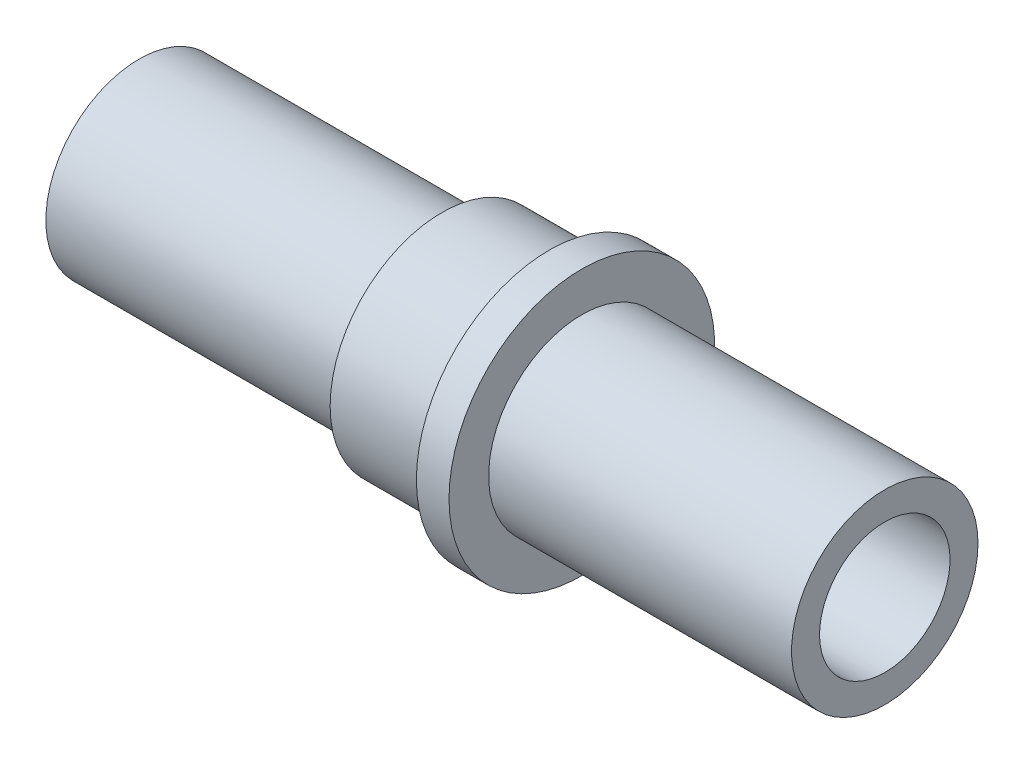
ISO-10303-21;
HEADER;
FILE_DESCRIPTION(('STEP AP214'),'2;1');
FILE_NAME('part.step','',(''),(''),'','','');
FILE_SCHEMA(('AUTOMOTIVE_DESIGN { 1 0 10303 214 1 1 1 1 }'));
ENDSEC;
DATA;
#1=APPLICATION_CONTEXT('core data for automotive mechanical design processes');
#2=APPLICATION_PROTOCOL_DEFINITION('international standard','automotive_design',2000,#1);
#3=PRODUCT_CONTEXT('',#1,'mechanical');
#4=PRODUCT('Part','Part','',(#3));
#5=PRODUCT_RELATED_PRODUCT_CATEGORY('part','',(#4));
#6=PRODUCT_DEFINITION_FORMATION('','',#4);
#7=PRODUCT_DEFINITION_CONTEXT('part definition',#1,'design');
#8=PRODUCT_DEFINITION('design','',#6,#7);
#9=PRODUCT_DEFINITION_SHAPE('','',#8);
#10=(LENGTH_UNIT() NAMED_UNIT(*) SI_UNIT(.MILLI.,.METRE.));
#11=(NAMED_UNIT(*) PLANE_ANGLE_UNIT() SI_UNIT($,.RADIAN.));
#12=(NAMED_UNIT(*) SI_UNIT($,.STERADIAN.) SOLID_ANGLE_UNIT());
#13=UNCERTAINTY_MEASURE_WITH_UNIT(LENGTH_MEASURE(1.E-05),#10,'distance_accuracy_value','');
#14=(GEOMETRIC_REPRESENTATION_CONTEXT(3) GLOBAL_UNCERTAINTY_ASSIGNED_CONTEXT((#13)) GLOBAL_UNIT_ASSIGNED_CONTEXT((#10,
#11,#12)) REPRESENTATION_CONTEXT('',''));
#15=CARTESIAN_POINT('',(0.,0.,0.));
#16=DIRECTION('',(0.,0.,1.));
#17=DIRECTION('',(1.,0.,0.));
#18=AXIS2_PLACEMENT_3D('',#15,#16,#17);
#19=CARTESIAN_POINT('',(80.,0.,-14.));
#20=DIRECTION('',(-1.,0.,0.));
#21=DIRECTION('',(0.,0.,1.));
#22=AXIS2_PLACEMENT_3D('',#19,#20,#21);
#23=PLANE('',#22);
#24=CARTESIAN_POINT('',(80.,0.,0.));
#25=DIRECTION('',(-1.,0.,0.));
#26=DIRECTION('',(0.,0.,1.));
#27=AXIS2_PLACEMENT_3D('',#24,#25,#26);
#28=CIRCLE('',#27,14.);
#29=CARTESIAN_POINT('',(80.,0.,14.));
#30=VERTEX_POINT('',#29);
#31=EDGE_CURVE('E337',#30,#30,#28,.T.);
#32=ORIENTED_EDGE('',*,*,#31,.T.);
#33=EDGE_LOOP('',(#32));
#34=FACE_BOUND('',#33,.T.);
#35=CARTESIAN_POINT('',(80.,0.,0.));
#36=DIRECTION('',(1.,0.,0.));
#37=DIRECTION('',(0.,0.,-1.));
#38=AXIS2_PLACEMENT_3D('',#35,#36,#37);
#39=CIRCLE('',#38,20.);
#40=CARTESIAN_POINT('',(80.,0.,-20.));
#41=VERTEX_POINT('',#40);
#42=EDGE_CURVE('E195',#41,#41,#39,.T.);
#43=ORIENTED_EDGE('',*,*,#42,.T.);
#44=EDGE_LOOP('',(#43));
#45=FACE_BOUND('',#44,.T.);
#46=ADVANCED_FACE('F36',(#34,#45),#23,.F.);
#47=CARTESIAN_POINT('',(51.5,0.,-85.));
#48=DIRECTION('',(0.,0.,1.));
#49=DIRECTION('',(1.,0.,0.));
#50=AXIS2_PLACEMENT_3D('',#47,#48,#49);
#51=CYLINDRICAL_SURFACE('',#50,2.75);
#52=CARTESIAN_POINT('',(54.25,0.,-15.5));
#53=CARTESIAN_POINT('',(54.2499939963702,-0.153180130361028,-15.4999972885771));
#54=CARTESIAN_POINT('',(54.2371581270707,-0.306440134931247,-15.4977057266277));
#55=CARTESIAN_POINT('',(54.1861810109078,-0.608651473095552,-15.4887849983757));
#56=CARTESIAN_POINT('',(54.1480174539571,-0.75759888708506,-15.4821520079637));
#57=CARTESIAN_POINT('',(54.0475819905019,-1.04676982237026,-15.4652914012013));
#58=CARTESIAN_POINT('',(53.9853308398008,-1.18700073408951,-15.4550668802993));
#59=CARTESIAN_POINT('',(53.8385439603777,-1.45501211811525,-15.4321435486864));
#60=CARTESIAN_POINT('',(53.754010404133,-1.58279380252694,-15.4194449792204));
#61=CARTESIAN_POINT('',(53.5640903864043,-1.82367177085956,-15.392825207877));
#62=CARTESIAN_POINT('',(53.4585105975018,-1.93661446910276,-15.3788933917032));
#63=CARTESIAN_POINT('',(53.2299111628025,-2.14328074013775,-15.3514573238523));
#64=CARTESIAN_POINT('',(53.1068903429675,-2.23700301807208,-15.3379531010336));
#65=CARTESIAN_POINT('',(52.845830548068,-2.40319530372064,-15.3127982803892));
#66=CARTESIAN_POINT('',(52.7076920504413,-2.47551123413061,-15.3011613847414));
#67=CARTESIAN_POINT('',(52.4209865611345,-2.59585222842665,-15.2812072720814));
#68=CARTESIAN_POINT('',(52.2724203719374,-2.64387915919015,-15.2728897999454));
#69=CARTESIAN_POINT('',(51.9707126947854,-2.71379037165771,-15.2606225605476));
#70=CARTESIAN_POINT('',(51.8176348132209,-2.73594119260959,-15.2566282937488));
#71=CARTESIAN_POINT('',(51.5098870542164,-2.75429827638896,-15.2533253385218));
#72=CARTESIAN_POINT('',(51.3552173054712,-2.75050662034128,-15.2540162742431));
#73=CARTESIAN_POINT('',(51.0505931626678,-2.71730299428448,-15.2599650838784));
#74=CARTESIAN_POINT('',(50.9006047305081,-2.68819227238425,-15.2651692568643));
#75=CARTESIAN_POINT('',(50.6076750627876,-2.60565045526888,-15.2794739594867));
#76=CARTESIAN_POINT('',(50.4647340983231,-2.5522184252887,-15.2885746388806));
#77=CARTESIAN_POINT('',(50.1890653515444,-2.42225075977002,-15.3097040089906));
#78=CARTESIAN_POINT('',(50.0563969689134,-2.34559176891981,-15.3217482649268));
#79=CARTESIAN_POINT('',(49.8056926891078,-2.17143365568382,-15.3473971637188));
#80=CARTESIAN_POINT('',(49.6876581276022,-2.07393263319782,-15.3610019487905));
#81=CARTESIAN_POINT('',(49.4678298898382,-1.85922540545412,-15.3884739714275));
#82=CARTESIAN_POINT('',(49.3662882295651,-1.74176112865291,-15.4023422075672));
#83=CARTESIAN_POINT('',(49.1843160503384,-1.49132991955348,-15.4286020251595));
#84=CARTESIAN_POINT('',(49.1038857031806,-1.35836286111228,-15.4409935945951));
#85=CARTESIAN_POINT('',(48.9663892511231,-1.08045057847522,-15.462925072433));
#86=CARTESIAN_POINT('',(48.9093473886423,-0.935493112112764,-15.4724620192382));
#87=CARTESIAN_POINT('',(48.8204914576501,-0.637847733020219,-15.4875864076149));
#88=CARTESIAN_POINT('',(48.7886749936342,-0.485160555799655,-15.4931742242061));
#89=CARTESIAN_POINT('',(48.7515192342325,-0.178560124995444,-15.499719785447));
#90=CARTESIAN_POINT('',(48.7458343110531,-0.0246900035401979,-15.5007379659188));
#91=CARTESIAN_POINT('',(48.7601787124678,0.281803018450218,-15.4981957721587));
#92=CARTESIAN_POINT('',(48.7802069107975,0.434425973318056,-15.494635598464));
#93=CARTESIAN_POINT('',(48.8451215906047,0.73301025947731,-15.4833742389245));
#94=CARTESIAN_POINT('',(48.8898350613166,0.879010386498074,-15.4757018847638));
#95=CARTESIAN_POINT('',(49.0026652014778,1.16144212089452,-15.4570728626086));
#96=CARTESIAN_POINT('',(49.0707833266586,1.29787313245106,-15.4461159903278));
#97=CARTESIAN_POINT('',(49.2292673561634,1.55878202434307,-15.4219828077083));
#98=CARTESIAN_POINT('',(49.3198468005166,1.68312822282852,-15.4087856023348));
#99=CARTESIAN_POINT('',(49.5203909273236,1.91497931304751,-15.3816938056365));
#100=CARTESIAN_POINT('',(49.6303572183307,2.02248280591962,-15.3677991565122));
#101=CARTESIAN_POINT('',(49.8681111328447,2.21889424843837,-15.3406804971823));
#102=CARTESIAN_POINT('',(49.9960939752784,2.30756747023747,-15.32746635088));
#103=CARTESIAN_POINT('',(50.2653418206475,2.46215643166306,-15.3033960908013));
#104=CARTESIAN_POINT('',(50.4066063637658,2.52807295876566,-15.2925398954347));
#105=CARTESIAN_POINT('',(50.697781683498,2.63493545141031,-15.2744904482524));
#106=CARTESIAN_POINT('',(50.8476502233147,2.6759935994284,-15.2672807648766));
#107=CARTESIAN_POINT('',(51.1522968470489,2.73232352690328,-15.2573012293778));
#108=CARTESIAN_POINT('',(51.3070744394966,2.74759787945412,-15.2545309342275));
#109=CARTESIAN_POINT('',(51.6147981715155,2.75184762497001,-15.2537646465042));
#110=CARTESIAN_POINT('',(51.7677391603609,2.74119285810098,-15.255701512772));
#111=CARTESIAN_POINT('',(52.0696142615317,2.69469154527426,-15.2639832956324));
#112=CARTESIAN_POINT('',(52.2185483920815,2.65884511391588,-15.2703281921723));
#113=CARTESIAN_POINT('',(52.5080109314647,2.5631270178078,-15.2866842128252));
#114=CARTESIAN_POINT('',(52.6485515674712,2.50329133116671,-15.2966898447602));
#115=CARTESIAN_POINT('',(52.917658894897,2.36133238124133,-15.3192445058943));
#116=CARTESIAN_POINT('',(53.046224863738,2.27920777416209,-15.331793688432));
#117=CARTESIAN_POINT('',(53.2895940005749,2.09369934417613,-15.3582321219391));
#118=CARTESIAN_POINT('',(53.4041891860807,1.99004486745666,-15.3721371042235));
#119=CARTESIAN_POINT('',(53.6144842305246,1.76498695279942,-15.3995988886769));
#120=CARTESIAN_POINT('',(53.7101797361345,1.64357943683116,-15.4131556100038));
#121=CARTESIAN_POINT('',(53.8806615462765,1.3853111016427,-15.4385189460145));
#122=CARTESIAN_POINT('',(53.9552758481905,1.24833526696905,-15.4503108145182));
#123=CARTESIAN_POINT('',(54.0803168976558,0.963633486922668,-15.470672261639));
#124=CARTESIAN_POINT('',(54.1307670507415,0.81591810436598,-15.4792449566202));
#125=CARTESIAN_POINT('',(54.1954501173467,0.556413889631343,-15.490392756442));
#126=CARTESIAN_POINT('',(54.2158724720239,0.446169564440767,-15.4939756739413));
#127=CARTESIAN_POINT('',(54.2431494651094,0.22396436987743,-15.4987802620907));
#128=CARTESIAN_POINT('',(54.2500043897846,0.112003536772482,-15.500001982561));
#129=CARTESIAN_POINT('',(54.25,0.,-15.5));
#130=B_SPLINE_CURVE_WITH_KNOTS('',3,(#52,#53,#54,#55,#56,#57,#58,#59,#60,#61,#62,#63,#64,#65,
#66,#67,#68,#69,#70,#71,#72,#73,#74,#75,#76,#77,#78,#79,#80,#81,#82,#83,#84,#85,#86,#87,#88,#89,
#90,#91,#92,#93,#94,#95,#96,#97,#98,#99,#100,#101,#102,#103,#104,#105,#106,#107,#108,#109,#110,
#111,#112,#113,#114,#115,#116,#117,#118,#119,#120,#121,#122,#123,#124,#125,#126,#127,#128,#129),
.UNSPECIFIED.,.T.,.F.,(4,2,2,2,2,2,2,2,2,2,2,2,2,2,2,2,2,2,2,2,2,2,2,2,2,2,2,2,2,2,2,2,2,2,2,2,
2,2,4),(0.,0.459130887515952,0.918666741724481,1.37780750160954,1.83690351299508,
2.30042905710988,2.76398581815316,3.23080224595071,3.69758278830366,4.15951159227084,
4.62140334039995,5.07787350295806,5.53436121097001,5.99331707175174,6.45231479190446,
6.91777389539432,7.3832367864947,7.84918092270293,8.31508080569667,8.77480040707501,
9.23449987289005,9.69101762643085,10.1475637797748,10.6086289377284,11.069732368912,
11.5362840564694,12.0028195977831,12.4672337221527,12.9316014975709,13.3893846785101,
13.8471657769628,14.3042628669993,14.7613875214604,15.2246502789878,15.6880196197348,
16.155067091883,16.6216612596877,16.9573795293277,17.2930907153809),.UNSPECIFIED.);
#131=CARTESIAN_POINT('',(48.75,0.,-15.5));
#132=VERTEX_POINT('',#131);
#133=CARTESIAN_POINT('',(54.25,0.,-15.5));
#134=VERTEX_POINT('',#133);
#135=EDGE_CURVE('E76',#132,#134,#130,.T.);
#136=ORIENTED_EDGE('',*,*,#135,.F.);
#137=EDGE_CURVE('E59',#134,#132,#130,.T.);
#138=ORIENTED_EDGE('',*,*,#137,.F.);
#139=EDGE_LOOP('',(#136,#138));
#140=FACE_BOUND('',#139,.T.);
#141=CARTESIAN_POINT('',(54.25,0.,-20.));
#142=CARTESIAN_POINT('',(54.249993556765,0.153691048302081,-19.9999976879118));
#143=CARTESIAN_POINT('',(54.2370723824231,0.307474866785848,-19.9982097880638));
#144=CARTESIAN_POINT('',(54.1857364594133,0.610754046163105,-19.9912495204842));
#145=CARTESIAN_POINT('',(54.147295948863,0.760244914044189,-19.9860737327388));
#146=CARTESIAN_POINT('',(54.0460831856731,1.05050443026029,-19.9729200836122));
#147=CARTESIAN_POINT('',(53.9833282770853,1.19127921315922,-19.9649442199732));
#148=CARTESIAN_POINT('',(53.8353082313726,1.46027546254501,-19.9470747441709));
#149=CARTESIAN_POINT('',(53.7500466026017,1.58849888127546,-19.937181430964));
#150=CARTESIAN_POINT('',(53.558831928412,1.82962437694935,-19.9165064057125));
#151=CARTESIAN_POINT('',(53.4527596510701,1.94243149144407,-19.9057197917769));
#152=CARTESIAN_POINT('',(53.2231910446311,2.14870361790335,-19.8845128481702));
#153=CARTESIAN_POINT('',(53.0996937753982,2.24216758556995,-19.8740925383002));
#154=CARTESIAN_POINT('',(52.8381532746243,2.40746197972028,-19.8547501988817));
#155=CARTESIAN_POINT('',(52.7000523950882,2.47920199596257,-19.8458344974589));
#156=CARTESIAN_POINT('',(52.4136192057626,2.59843449792071,-19.8305767271721));
#157=CARTESIAN_POINT('',(52.2652873646832,2.64592809359916,-19.8242345404993));
#158=CARTESIAN_POINT('',(51.9635952156628,2.71502784404444,-19.8148894574374));
#159=CARTESIAN_POINT('',(51.8102725525694,2.73679549136394,-19.81186573829));
#160=CARTESIAN_POINT('',(51.5021230204438,2.754325433017,-19.8094364998907));
#161=CARTESIAN_POINT('',(51.3472962245755,2.75008898597912,-19.8100308055221));
#162=CARTESIAN_POINT('',(51.0416661439927,2.71586327569488,-19.8147514149341));
#163=CARTESIAN_POINT('',(50.8908424005475,2.68605283888437,-19.8188531920345));
#164=CARTESIAN_POINT('',(50.5963583824647,2.60180481135229,-19.8300883008704));
#165=CARTESIAN_POINT('',(50.4526982807183,2.54736662657047,-19.8372217057334));
#166=CARTESIAN_POINT('',(50.1760694616357,2.41521917583683,-19.853743790879));
#167=CARTESIAN_POINT('',(50.043137878724,2.33743314066148,-19.86313989058));
#168=CARTESIAN_POINT('',(49.7921467825863,2.16085284684145,-19.883123118533));
#169=CARTESIAN_POINT('',(49.674088091884,2.06205742711449,-19.8937103125955));
#170=CARTESIAN_POINT('',(49.4551567976275,1.84527625482177,-19.9149915483879));
#171=CARTESIAN_POINT('',(49.3544365899711,1.72713654653894,-19.9256857417053));
#172=CARTESIAN_POINT('',(49.1742311055461,1.47554786234239,-19.9458932662357));
#173=CARTESIAN_POINT('',(49.0947458969199,1.34209883730352,-19.9554065936593));
#174=CARTESIAN_POINT('',(48.9592629163206,1.06355516601991,-19.9721882349705));
#175=CARTESIAN_POINT('',(48.9032757441426,0.918455299247463,-19.9794555353027));
#176=CARTESIAN_POINT('',(48.8165045661456,0.620791279029389,-19.990917492439));
#177=CARTESIAN_POINT('',(48.7857191307701,0.468227549488177,-19.995112323526));
#178=CARTESIAN_POINT('',(48.7504252761674,0.161283058145392,-19.9999338446021));
#179=CARTESIAN_POINT('',(48.7457071267834,0.00692684232008186,-20.0005890127891));
#180=CARTESIAN_POINT('',(48.7621267616201,-0.3003742868181,-19.9983345801951));
#181=CARTESIAN_POINT('',(48.7832638764852,-0.453319236563339,-19.9954250716985));
#182=CARTESIAN_POINT('',(48.8506197084105,-0.752829586427977,-19.986385858488));
#183=CARTESIAN_POINT('',(48.8967373812643,-0.899418135103156,-19.9802691298716));
#184=CARTESIAN_POINT('',(49.0126394486303,-1.18278160079774,-19.9654996606529));
#185=CARTESIAN_POINT('',(49.0824247971592,-1.31955612195573,-19.9568468178248));
#186=CARTESIAN_POINT('',(49.2441813284002,-1.58033880542293,-19.9378973265661));
#187=CARTESIAN_POINT('',(49.3362869259039,-1.7042628671375,-19.9275908519361));
#188=CARTESIAN_POINT('',(49.5398807095436,-1.93496873160381,-19.9065150547392));
#189=CARTESIAN_POINT('',(49.6513698340405,-2.04174970397319,-19.8957457097836));
#190=CARTESIAN_POINT('',(49.8914945464765,-2.23589151734344,-19.8748688995989));
#191=CARTESIAN_POINT('',(50.0202436634895,-2.32311257053476,-19.8647665414263));
#192=CARTESIAN_POINT('',(50.2906878545255,-2.47469012437468,-19.8464546602125));
#193=CARTESIAN_POINT('',(50.4323826243274,-2.5390471621512,-19.838245092707));
#194=CARTESIAN_POINT('',(50.7242612690282,-2.64284809930283,-19.8246842167451));
#195=CARTESIAN_POINT('',(50.8744175863039,-2.68236829607907,-19.8193241626372));
#196=CARTESIAN_POINT('',(51.1793144373862,-2.73561813038544,-19.8120450180285));
#197=CARTESIAN_POINT('',(51.3340547085819,-2.74934924245849,-19.8101257307952));
#198=CARTESIAN_POINT('',(51.6423351128222,-2.75060023253872,-19.809951954788));
#199=CARTESIAN_POINT('',(51.7958743828355,-2.73833979250839,-19.8116667505137));
#200=CARTESIAN_POINT('',(52.0986866416265,-2.68842356823614,-19.8185015492629));
#201=CARTESIAN_POINT('',(52.2479596331651,-2.65076780042872,-19.8236215500829));
#202=CARTESIAN_POINT('',(52.5379577433389,-2.55120289622579,-19.8366797711636));
#203=CARTESIAN_POINT('',(52.6786873569408,-2.48930664358651,-19.8446164941339));
#204=CARTESIAN_POINT('',(52.9477992253764,-2.34303939462444,-19.8624160290793));
#205=CARTESIAN_POINT('',(53.0761811982783,-2.25866788529321,-19.872278885018));
#206=CARTESIAN_POINT('',(53.3180734263252,-2.06903786707165,-19.8929190033365));
#207=CARTESIAN_POINT('',(53.4314550912826,-1.96361604756685,-19.9037030122198));
#208=CARTESIAN_POINT('',(53.6389992301106,-1.73522182634597,-19.9249123085487));
#209=CARTESIAN_POINT('',(53.7331572001367,-1.61224532325241,-19.9353375114564));
#210=CARTESIAN_POINT('',(53.8999595769867,-1.35157476242149,-19.9547084991948));
#211=CARTESIAN_POINT('',(53.9725030981721,-1.21381564808709,-19.9636472629714));
#212=CARTESIAN_POINT('',(54.0933186529561,-0.928017694341463,-19.9789684515391));
#213=CARTESIAN_POINT('',(54.1416164726682,-0.779989967531116,-19.9853535907188));
#214=CARTESIAN_POINT('',(54.2012954052979,-0.526036164028963,-19.9933476747436));
#215=CARTESIAN_POINT('',(54.21953259448,-0.421696231828042,-19.9958298315073));
#216=CARTESIAN_POINT('',(54.2438870515407,-0.21158551548677,-19.9991567821786));
#217=CARTESIAN_POINT('',(54.2500044361027,-0.105814745131687,-20.0000015918496));
#218=CARTESIAN_POINT('',(54.25,0.,-20.));
#219=B_SPLINE_CURVE_WITH_KNOTS('',3,(#141,#142,#143,#144,#145,#146,#147,#148,#149,#150,#151,
#152,#153,#154,#155,#156,#157,#158,#159,#160,#161,#162,#163,#164,#165,#166,#167,#168,#169,#170,
#171,#172,#173,#174,#175,#176,#177,#178,#179,#180,#181,#182,#183,#184,#185,#186,#187,#188,#189,
#190,#191,#192,#193,#194,#195,#196,#197,#198,#199,#200,#201,#202,#203,#204,#205,#206,#207,#208,
#209,#210,#211,#212,#213,#214,#215,#216,#217,#218),.UNSPECIFIED.,.T.,.F.,(4,2,2,2,2,2,2,2,2,2,2,
2,2,2,2,2,2,2,2,2,2,2,2,2,2,2,2,2,2,2,2,2,2,2,2,2,2,2,4),(0.,0.460686566621732,
0.921838907005325,1.38266290003487,1.84341510206454,2.30688856308806,2.77038703959676,
3.23578878962265,3.70116923238555,4.16361250233735,4.62603338967068,5.08524690610813,
5.54447150009298,6.00522291014889,6.46599979022204,6.93064004546858,7.39528179171355,
7.86013290981609,8.32495765763194,8.7860370477441,9.24710450142771,9.70632075397659,
10.1655555192026,10.6276277437701,11.0897223435888,11.5550209869023,12.0203086985659,
12.4841599942269,12.9479847674472,13.4079049062956,13.8678247475085,14.3275004735171,
14.787186692742,15.2505884002799,15.7140985521237,16.1797394187917,16.6448840060744,
16.962065139875,17.2792432199988),.UNSPECIFIED.);
#220=CARTESIAN_POINT('',(54.25,0.,-20.));
#221=VERTEX_POINT('',#220);
#222=EDGE_CURVE('E187',#221,#221,#219,.T.);
#223=ORIENTED_EDGE('',*,*,#222,.F.);
#224=EDGE_LOOP('',(#223));
#225=FACE_BOUND('',#224,.T.);
#226=ADVANCED_FACE('F99',(#140,#225),#51,.F.);
#227=CARTESIAN_POINT('',(-80.,0.,-24.));
#228=DIRECTION('',(1.,0.,0.));
#229=DIRECTION('',(0.,0.,-1.));
#230=AXIS2_PLACEMENT_3D('',#227,#228,#229);
#231=PLANE('',#230);
#232=CARTESIAN_POINT('',(-80.,0.,0.));
#233=DIRECTION('',(-1.,0.,0.));
#234=DIRECTION('',(0.,0.,1.));
#235=AXIS2_PLACEMENT_3D('',#232,#233,#234);
#236=CIRCLE('',#235,14.);
#237=CARTESIAN_POINT('',(-80.,0.,14.));
#238=VERTEX_POINT('',#237);
#239=EDGE_CURVE('E11',#238,#238,#236,.T.);
#240=ORIENTED_EDGE('',*,*,#239,.F.);
#241=EDGE_LOOP('',(#240));
#242=FACE_BOUND('',#241,.T.);
#243=CARTESIAN_POINT('',(-80.,0.,0.));
#244=DIRECTION('',(1.,0.,0.));
#245=DIRECTION('',(0.,0.,-1.));
#246=AXIS2_PLACEMENT_3D('',#243,#244,#245);
#247=CIRCLE('',#246,20.);
#248=CARTESIAN_POINT('',(-80.,0.,-20.));
#249=VERTEX_POINT('',#248);
#250=EDGE_CURVE('E83',#249,#249,#247,.T.);
#251=ORIENTED_EDGE('',*,*,#250,.F.);
#252=EDGE_LOOP('',(#251));
#253=FACE_BOUND('',#252,.T.);
#254=ADVANCED_FACE('F38',(#242,#253),#231,.F.);
#255=CARTESIAN_POINT('',(-80.,0.,0.));
#256=DIRECTION('',(-1.,0.,0.));
#257=DIRECTION('',(0.,0.,1.));
#258=AXIS2_PLACEMENT_3D('',#255,#256,#257);
#259=CYLINDRICAL_SURFACE('',#258,14.);
#260=CARTESIAN_POINT('',(-54.25,0.,0.));
#261=DIRECTION('',(-1.,0.,0.));
#262=DIRECTION('',(0.,0.,1.));
#263=AXIS2_PLACEMENT_3D('',#260,#261,#262);
#264=CIRCLE('',#263,14.);
#265=CARTESIAN_POINT('',(-54.25,0.,14.));
#266=VERTEX_POINT('',#265);
#267=EDGE_CURVE('E45',#266,#266,#264,.T.);
#268=ORIENTED_EDGE('',*,*,#267,.F.);
#269=EDGE_LOOP('',(#268));
#270=FACE_BOUND('',#269,.T.);
#271=ORIENTED_EDGE('',*,*,#239,.T.);
#272=EDGE_LOOP('',(#271));
#273=FACE_BOUND('',#272,.T.);
#274=ADVANCED_FACE('F177',(#270,#273),#259,.F.);
#275=CARTESIAN_POINT('',(-54.25,0.,-14.));
#276=DIRECTION('',(-1.,0.,0.));
#277=DIRECTION('',(0.,0.,1.));
#278=AXIS2_PLACEMENT_3D('',#275,#276,#277);
#279=PLANE('',#278);
#280=ORIENTED_EDGE('',*,*,#267,.T.);
#281=EDGE_LOOP('',(#280));
#282=FACE_BOUND('',#281,.T.);
#283=CARTESIAN_POINT('',(-54.25,0.,0.));
#284=DIRECTION('',(-1.,0.,0.));
#285=DIRECTION('',(0.,0.,1.));
#286=AXIS2_PLACEMENT_3D('',#283,#284,#285);
#287=CIRCLE('',#286,15.5);
#288=CARTESIAN_POINT('',(-54.25,0.,-15.5));
#289=VERTEX_POINT('',#288);
#290=EDGE_CURVE('E74',#289,#289,#287,.T.);
#291=ORIENTED_EDGE('',*,*,#290,.F.);
#292=EDGE_LOOP('',(#291));
#293=FACE_BOUND('',#292,.T.);
#294=ADVANCED_FACE('F162',(#282,#293),#279,.F.);
#295=CARTESIAN_POINT('',(-80.,0.,0.));
#296=DIRECTION('',(-1.,0.,0.));
#297=DIRECTION('',(0.,0.,1.));
#298=AXIS2_PLACEMENT_3D('',#295,#296,#297);
#299=CYLINDRICAL_SURFACE('',#298,15.5);
#300=CARTESIAN_POINT('',(-48.75,0.,0.));
#301=DIRECTION('',(-1.,0.,0.));
#302=DIRECTION('',(0.,0.,1.));
#303=AXIS2_PLACEMENT_3D('',#300,#301,#302);
#304=CIRCLE('',#303,15.5);
#305=CARTESIAN_POINT('',(-48.75,0.,-15.5));
#306=VERTEX_POINT('',#305);
#307=EDGE_CURVE('E75',#306,#306,#304,.T.);
#308=ORIENTED_EDGE('',*,*,#307,.F.);
#309=CARTESIAN_POINT('',(-48.75,0.,-15.5));
#310=CARTESIAN_POINT('',(-48.7500060036299,-0.153180130361028,-15.4999972885771));
#311=CARTESIAN_POINT('',(-48.7628418729293,-0.306440134931246,-15.4977057266277));
#312=CARTESIAN_POINT('',(-48.8138189890922,-0.608651473095552,-15.4887849983757));
#313=CARTESIAN_POINT('',(-48.851982546043,-0.75759888708506,-15.4821520079637));
#314=CARTESIAN_POINT('',(-48.9524180094982,-1.04676982237026,-15.4652914012013));
#315=CARTESIAN_POINT('',(-49.0146691601992,-1.18700073408951,-15.4550668802993));
#316=CARTESIAN_POINT('',(-49.1614560396224,-1.45501211811525,-15.4321435486864));
#317=CARTESIAN_POINT('',(-49.2459895958671,-1.58279380252694,-15.4194449792204));
#318=CARTESIAN_POINT('',(-49.4359096135957,-1.82367177085956,-15.392825207877));
#319=CARTESIAN_POINT('',(-49.5414894024983,-1.93661446910276,-15.3788933917032));
#320=CARTESIAN_POINT('',(-49.7700888371975,-2.14328074013775,-15.3514573238523));
#321=CARTESIAN_POINT('',(-49.8931096570326,-2.23700301807208,-15.3379531010336));
#322=CARTESIAN_POINT('',(-50.154169451932,-2.40319530372064,-15.3127982803892));
#323=CARTESIAN_POINT('',(-50.2923079495588,-2.47551123413061,-15.3011613847414));
#324=CARTESIAN_POINT('',(-50.5790134388655,-2.59585222842665,-15.2812072720814));
#325=CARTESIAN_POINT('',(-50.7275796280626,-2.64387915919015,-15.2728897999454));
#326=CARTESIAN_POINT('',(-51.0292873052146,-2.71379037165771,-15.2606225605476));
#327=CARTESIAN_POINT('',(-51.1823651867791,-2.73594119260959,-15.2566282937488));
#328=CARTESIAN_POINT('',(-51.4901129457836,-2.75429827638896,-15.2533253385218));
#329=CARTESIAN_POINT('',(-51.6447826945289,-2.75050662034128,-15.2540162742431));
#330=CARTESIAN_POINT('',(-51.9494068373323,-2.71730299428448,-15.2599650838784));
#331=CARTESIAN_POINT('',(-52.0993952694919,-2.68819227238425,-15.2651692568643));
#332=CARTESIAN_POINT('',(-52.3923249372125,-2.60565045526888,-15.2794739594867));
#333=CARTESIAN_POINT('',(-52.535265901677,-2.5522184252887,-15.2885746388806));
#334=CARTESIAN_POINT('',(-52.8109346484556,-2.42225075977001,-15.3097040089906));
#335=CARTESIAN_POINT('',(-52.9436030310866,-2.34559176891981,-15.3217482649268));
#336=CARTESIAN_POINT('',(-53.1943073108923,-2.17143365568382,-15.3473971637188));
#337=CARTESIAN_POINT('',(-53.3123418723978,-2.07393263319782,-15.3610019487905));
#338=CARTESIAN_POINT('',(-53.5321701101618,-1.85922540545412,-15.3884739714275));
#339=CARTESIAN_POINT('',(-53.6337117704349,-1.74176112865291,-15.4023422075672));
#340=CARTESIAN_POINT('',(-53.8156839496617,-1.49132991955348,-15.4286020251595));
#341=CARTESIAN_POINT('',(-53.8961142968195,-1.35836286111228,-15.4409935945951));
#342=CARTESIAN_POINT('',(-54.033610748877,-1.08045057847522,-15.462925072433));
#343=CARTESIAN_POINT('',(-54.0906526113577,-0.935493112112767,-15.4724620192382));
#344=CARTESIAN_POINT('',(-54.17950854235,-0.637847733020222,-15.4875864076149));
#345=CARTESIAN_POINT('',(-54.2113250063658,-0.485160555799656,-15.4931742242061));
#346=CARTESIAN_POINT('',(-54.2484807657675,-0.178560124995443,-15.499719785447));
#347=CARTESIAN_POINT('',(-54.2541656889469,-0.0246900035401971,-15.5007379659188));
#348=CARTESIAN_POINT('',(-54.2398212875322,0.281803018450219,-15.4981957721587));
#349=CARTESIAN_POINT('',(-54.2197930892025,0.434425973318057,-15.494635598464));
#350=CARTESIAN_POINT('',(-54.1548784093954,0.733010259477311,-15.4833742389245));
#351=CARTESIAN_POINT('',(-54.1101649386834,0.879010386498076,-15.4757018847638));
#352=CARTESIAN_POINT('',(-53.9973347985222,1.16144212089453,-15.4570728626086));
#353=CARTESIAN_POINT('',(-53.9292166733415,1.29787313245106,-15.4461159903278));
#354=CARTESIAN_POINT('',(-53.7707326438366,1.55878202434307,-15.4219828077083));
#355=CARTESIAN_POINT('',(-53.6801531994834,1.68312822282852,-15.4087856023348));
#356=CARTESIAN_POINT('',(-53.4796090726764,1.91497931304751,-15.3816938056365));
#357=CARTESIAN_POINT('',(-53.3696427816694,2.02248280591962,-15.3677991565122));
#358=CARTESIAN_POINT('',(-53.1318888671553,2.21889424843837,-15.3406804971823));
#359=CARTESIAN_POINT('',(-53.0039060247217,2.30756747023748,-15.32746635088));
#360=CARTESIAN_POINT('',(-52.7346581793525,2.46215643166307,-15.3033960908013));
#361=CARTESIAN_POINT('',(-52.5933936362343,2.52807295876566,-15.2925398954347));
#362=CARTESIAN_POINT('',(-52.3022183165021,2.63493545141031,-15.2744904482524));
#363=CARTESIAN_POINT('',(-52.1523497766853,2.6759935994284,-15.2672807648766));
#364=CARTESIAN_POINT('',(-51.8477031529511,2.73232352690328,-15.2573012293778));
#365=CARTESIAN_POINT('',(-51.6929255605034,2.74759787945412,-15.2545309342275));
#366=CARTESIAN_POINT('',(-51.3852018284845,2.75184762497001,-15.2537646465042));
#367=CARTESIAN_POINT('',(-51.2322608396392,2.74119285810098,-15.255701512772));
#368=CARTESIAN_POINT('',(-50.9303857384684,2.69469154527426,-15.2639832956324));
#369=CARTESIAN_POINT('',(-50.7814516079185,2.65884511391588,-15.2703281921723));
#370=CARTESIAN_POINT('',(-50.4919890685354,2.5631270178078,-15.2866842128252));
#371=CARTESIAN_POINT('',(-50.3514484325289,2.50329133116671,-15.2966898447602));
#372=CARTESIAN_POINT('',(-50.082341105103,2.36133238124133,-15.3192445058943));
#373=CARTESIAN_POINT('',(-49.9537751362621,2.27920777416208,-15.331793688432));
#374=CARTESIAN_POINT('',(-49.7104059994251,2.09369934417613,-15.3582321219391));
#375=CARTESIAN_POINT('',(-49.5958108139194,1.99004486745666,-15.3721371042235));
#376=CARTESIAN_POINT('',(-49.3855157694755,1.76498695279942,-15.3995988886769));
#377=CARTESIAN_POINT('',(-49.2898202638655,1.64357943683116,-15.4131556100038));
#378=CARTESIAN_POINT('',(-49.1193384537236,1.3853111016427,-15.4385189460145));
#379=CARTESIAN_POINT('',(-49.0447241518095,1.24833526696905,-15.4503108145182));
#380=CARTESIAN_POINT('',(-48.9196831023443,0.963633486922667,-15.470672261639));
#381=CARTESIAN_POINT('',(-48.8692329492586,0.815918104365978,-15.4792449566202));
#382=CARTESIAN_POINT('',(-48.8045498826534,0.556413889631342,-15.490392756442));
#383=CARTESIAN_POINT('',(-48.7841275279761,0.446169564440766,-15.4939756739413));
#384=CARTESIAN_POINT('',(-48.7568505348906,0.22396436987743,-15.4987802620907));
#385=CARTESIAN_POINT('',(-48.7499956102154,0.112003536772482,-15.500001982561));
#386=CARTESIAN_POINT('',(-48.75,0.,-15.5));
#387=B_SPLINE_CURVE_WITH_KNOTS('',3,(#309,#310,#311,#312,#313,#314,#315,#316,#317,#318,#319,
#320,#321,#322,#323,#324,#325,#326,#327,#328,#329,#330,#331,#332,#333,#334,#335,#336,#337,#338,
#339,#340,#341,#342,#343,#344,#345,#346,#347,#348,#349,#350,#351,#352,#353,#354,#355,#356,#357,
#358,#359,#360,#361,#362,#363,#364,#365,#366,#367,#368,#369,#370,#371,#372,#373,#374,#375,#376,
#377,#378,#379,#380,#381,#382,#383,#384,#385,#386),.UNSPECIFIED.,.T.,.F.,(4,2,2,2,2,2,2,2,2,2,2,
2,2,2,2,2,2,2,2,2,2,2,2,2,2,2,2,2,2,2,2,2,2,2,2,2,2,2,4),(0.,0.459130887515952,
0.918666741724481,1.37780750160954,1.83690351299508,2.30042905710988,2.76398581815316,
3.23080224595071,3.69758278830366,4.15951159227084,4.62140334039995,5.07787350295806,
5.53436121097002,5.99331707175175,6.45231479190446,6.91777389539432,7.3832367864947,
7.84918092270293,8.31508080569667,8.77480040707501,9.23449987289006,9.69101762643085,
10.1475637797748,10.6086289377284,11.069732368912,11.5362840564694,12.0028195977831,
12.4672337221527,12.9316014975709,13.3893846785101,13.8471657769628,14.3042628669993,
14.7613875214604,15.2246502789878,15.6880196197348,16.155067091883,16.6216612596877,
16.9573795293277,17.2930907153809),.UNSPECIFIED.);
#388=EDGE_CURVE('E52',#306,#289,#387,.T.);
#389=ORIENTED_EDGE('',*,*,#388,.T.);
#390=ORIENTED_EDGE('',*,*,#290,.T.);
#391=EDGE_CURVE('E64',#289,#306,#387,.T.);
#392=ORIENTED_EDGE('',*,*,#391,.T.);
#393=EDGE_LOOP('',(#308,#389,#390,#392));
#394=FACE_BOUND('',#393,.T.);
#395=ADVANCED_FACE('F72',(#394),#299,.F.);
#396=CARTESIAN_POINT('',(-48.75,0.,-14.));
#397=DIRECTION('',(1.,0.,0.));
#398=DIRECTION('',(0.,0.,-1.));
#399=AXIS2_PLACEMENT_3D('',#396,#397,#398);
#400=PLANE('',#399);
#401=CARTESIAN_POINT('',(-48.75,0.,0.));
#402=DIRECTION('',(-1.,0.,0.));
#403=DIRECTION('',(0.,0.,1.));
#404=AXIS2_PLACEMENT_3D('',#401,#402,#403);
#405=CIRCLE('',#404,14.);
#406=CARTESIAN_POINT('',(-48.75,0.,14.));
#407=VERTEX_POINT('',#406);
#408=EDGE_CURVE('E166',#407,#407,#405,.T.);
#409=ORIENTED_EDGE('',*,*,#408,.F.);
#410=EDGE_LOOP('',(#409));
#411=FACE_BOUND('',#410,.T.);
#412=ORIENTED_EDGE('',*,*,#307,.T.);
#413=EDGE_LOOP('',(#412));
#414=FACE_BOUND('',#413,.T.);
#415=ADVANCED_FACE('F155',(#411,#414),#400,.F.);
#416=CARTESIAN_POINT('',(-80.,0.,0.));
#417=DIRECTION('',(-1.,0.,0.));
#418=DIRECTION('',(0.,0.,1.));
#419=AXIS2_PLACEMENT_3D('',#416,#417,#418);
#420=CYLINDRICAL_SURFACE('',#419,14.);
#421=CARTESIAN_POINT('',(48.75,0.,0.));
#422=DIRECTION('',(-1.,0.,0.));
#423=DIRECTION('',(0.,0.,1.));
#424=AXIS2_PLACEMENT_3D('',#421,#422,#423);
#425=CIRCLE('',#424,14.);
#426=CARTESIAN_POINT('',(48.75,0.,14.));
#427=VERTEX_POINT('',#426);
#428=EDGE_CURVE('E169',#427,#427,#425,.T.);
#429=ORIENTED_EDGE('',*,*,#428,.F.);
#430=EDGE_LOOP('',(#429));
#431=FACE_BOUND('',#430,.T.);
#432=ORIENTED_EDGE('',*,*,#408,.T.);
#433=EDGE_LOOP('',(#432));
#434=FACE_BOUND('',#433,.T.);
#435=ADVANCED_FACE('F152',(#431,#434),#420,.F.);
#436=CARTESIAN_POINT('',(48.75,0.,-15.5));
#437=DIRECTION('',(-1.,0.,0.));
#438=DIRECTION('',(0.,0.,1.));
#439=AXIS2_PLACEMENT_3D('',#436,#437,#438);
#440=PLANE('',#439);
#441=ORIENTED_EDGE('',*,*,#428,.T.);
#442=EDGE_LOOP('',(#441));
#443=FACE_BOUND('',#442,.T.);
#444=CARTESIAN_POINT('',(48.75,0.,0.));
#445=DIRECTION('',(-1.,0.,0.));
#446=DIRECTION('',(0.,0.,1.));
#447=AXIS2_PLACEMENT_3D('',#444,#445,#446);
#448=CIRCLE('',#447,15.5);
#449=EDGE_CURVE('E349',#132,#132,#448,.T.);
#450=ORIENTED_EDGE('',*,*,#449,.F.);
#451=EDGE_LOOP('',(#450));
#452=FACE_BOUND('',#451,.T.);
#453=ADVANCED_FACE('F148',(#443,#452),#440,.F.);
#454=CARTESIAN_POINT('',(-80.,0.,0.));
#455=DIRECTION('',(-1.,0.,0.));
#456=DIRECTION('',(0.,0.,1.));
#457=AXIS2_PLACEMENT_3D('',#454,#455,#456);
#458=CYLINDRICAL_SURFACE('',#457,15.5);
#459=CARTESIAN_POINT('',(54.25,0.,0.));
#460=DIRECTION('',(-1.,0.,0.));
#461=DIRECTION('',(0.,0.,1.));
#462=AXIS2_PLACEMENT_3D('',#459,#460,#461);
#463=CIRCLE('',#462,15.5);
#464=EDGE_CURVE('E346',#134,#134,#463,.T.);
#465=ORIENTED_EDGE('',*,*,#464,.F.);
#466=ORIENTED_EDGE('',*,*,#137,.T.);
#467=ORIENTED_EDGE('',*,*,#449,.T.);
#468=ORIENTED_EDGE('',*,*,#135,.T.);
#469=EDGE_LOOP('',(#465,#466,#467,#468));
#470=FACE_BOUND('',#469,.T.);
#471=ADVANCED_FACE('F143',(#470),#458,.F.);
#472=CARTESIAN_POINT('',(54.25,0.,-15.5));
#473=DIRECTION('',(1.,0.,0.));
#474=DIRECTION('',(0.,0.,-1.));
#475=AXIS2_PLACEMENT_3D('',#472,#473,#474);
#476=PLANE('',#475);
#477=CARTESIAN_POINT('',(54.25,0.,0.));
#478=DIRECTION('',(-1.,0.,0.));
#479=DIRECTION('',(0.,0.,1.));
#480=AXIS2_PLACEMENT_3D('',#477,#478,#479);
#481=CIRCLE('',#480,14.);
#482=CARTESIAN_POINT('',(54.25,0.,14.));
#483=VERTEX_POINT('',#482);
#484=EDGE_CURVE('E340',#483,#483,#481,.T.);
#485=ORIENTED_EDGE('',*,*,#484,.F.);
#486=EDGE_LOOP('',(#485));
#487=FACE_BOUND('',#486,.T.);
#488=ORIENTED_EDGE('',*,*,#464,.T.);
#489=EDGE_LOOP('',(#488));
#490=FACE_BOUND('',#489,.T.);
#491=ADVANCED_FACE('F140',(#487,#490),#476,.F.);
#492=CARTESIAN_POINT('',(-80.,0.,0.));
#493=DIRECTION('',(-1.,0.,0.));
#494=DIRECTION('',(0.,0.,1.));
#495=AXIS2_PLACEMENT_3D('',#492,#493,#494);
#496=CYLINDRICAL_SURFACE('',#495,14.);
#497=ORIENTED_EDGE('',*,*,#31,.F.);
#498=EDGE_LOOP('',(#497));
#499=FACE_BOUND('',#498,.T.);
#500=ORIENTED_EDGE('',*,*,#484,.T.);
#501=EDGE_LOOP('',(#500));
#502=FACE_BOUND('',#501,.T.);
#503=ADVANCED_FACE('F137',(#499,#502),#496,.F.);
#504=CARTESIAN_POINT('',(-80.,0.,0.));
#505=DIRECTION('',(-1.,0.,0.));
#506=DIRECTION('',(0.,0.,1.));
#507=AXIS2_PLACEMENT_3D('',#504,#505,#506);
#508=CYLINDRICAL_SURFACE('',#507,28.5);
#509=CARTESIAN_POINT('',(15.,0.,0.));
#510=DIRECTION('',(-1.,0.,0.));
#511=DIRECTION('',(0.,0.,1.));
#512=AXIS2_PLACEMENT_3D('',#509,#510,#511);
#513=CIRCLE('',#512,28.5);
#514=CARTESIAN_POINT('',(15.,0.,28.5));
#515=VERTEX_POINT('',#514);
#516=EDGE_CURVE('E40',#515,#515,#513,.T.);
#517=ORIENTED_EDGE('',*,*,#516,.T.);
#518=EDGE_LOOP('',(#517));
#519=FACE_BOUND('',#518,.T.);
#520=CARTESIAN_POINT('',(7.99999999999999,0.,0.));
#521=DIRECTION('',(-1.,0.,0.));
#522=DIRECTION('',(0.,0.,1.));
#523=AXIS2_PLACEMENT_3D('',#520,#521,#522);
#524=CIRCLE('',#523,28.5);
#525=CARTESIAN_POINT('',(7.99999999999999,0.,28.5));
#526=VERTEX_POINT('',#525);
#527=EDGE_CURVE('E335',#526,#526,#524,.T.);
#528=ORIENTED_EDGE('',*,*,#527,.F.);
#529=EDGE_LOOP('',(#528));
#530=FACE_BOUND('',#529,.T.);
#531=ADVANCED_FACE('F136',(#519,#530),#508,.T.);
#532=CARTESIAN_POINT('',(8.,0.,-28.5));
#533=DIRECTION('',(1.,0.,0.));
#534=DIRECTION('',(0.,0.,-1.));
#535=AXIS2_PLACEMENT_3D('',#532,#533,#534);
#536=PLANE('',#535);
#537=CARTESIAN_POINT('',(7.99999999999999,0.,0.));
#538=DIRECTION('',(-1.,0.,0.));
#539=DIRECTION('',(0.,0.,1.));
#540=AXIS2_PLACEMENT_3D('',#537,#538,#539);
#541=CIRCLE('',#540,24.);
#542=CARTESIAN_POINT('',(7.99999999999999,0.,24.));
#543=VERTEX_POINT('',#542);
#544=EDGE_CURVE('E338',#543,#543,#541,.T.);
#545=ORIENTED_EDGE('',*,*,#544,.F.);
#546=EDGE_LOOP('',(#545));
#547=FACE_BOUND('',#546,.T.);
#548=ORIENTED_EDGE('',*,*,#527,.T.);
#549=EDGE_LOOP('',(#548));
#550=FACE_BOUND('',#549,.T.);
#551=ADVANCED_FACE('F241',(#547,#550),#536,.F.);
#552=CARTESIAN_POINT('',(-80.,0.,0.));
#553=DIRECTION('',(-1.,0.,0.));
#554=DIRECTION('',(0.,0.,1.));
#555=AXIS2_PLACEMENT_3D('',#552,#553,#554);
#556=CYLINDRICAL_SURFACE('',#555,24.);
#557=CARTESIAN_POINT('',(-15.,0.,0.));
#558=DIRECTION('',(1.,0.,0.));
#559=DIRECTION('',(0.,0.,-1.));
#560=AXIS2_PLACEMENT_3D('',#557,#558,#559);
#561=CIRCLE('',#560,24.);
#562=CARTESIAN_POINT('',(-15.,0.,-24.));
#563=VERTEX_POINT('',#562);
#564=EDGE_CURVE('E70',#563,#563,#561,.T.);
#565=ORIENTED_EDGE('',*,*,#564,.T.);
#566=EDGE_LOOP('',(#565));
#567=FACE_BOUND('',#566,.T.);
#568=ORIENTED_EDGE('',*,*,#544,.T.);
#569=EDGE_LOOP('',(#568));
#570=FACE_BOUND('',#569,.T.);
#571=ADVANCED_FACE('F97',(#567,#570),#556,.T.);
#572=CARTESIAN_POINT('',(-51.5,0.,-85.));
#573=DIRECTION('',(0.,0.,1.));
#574=DIRECTION('',(1.,0.,0.));
#575=AXIS2_PLACEMENT_3D('',#572,#573,#574);
#576=CYLINDRICAL_SURFACE('',#575,2.75);
#577=CARTESIAN_POINT('',(-48.75,0.,-20.));
#578=CARTESIAN_POINT('',(-48.7500064432351,-0.153691048302081,-19.9999976879118));
#579=CARTESIAN_POINT('',(-48.762927617577,-0.307474866785848,-19.9982097880638));
#580=CARTESIAN_POINT('',(-48.8142635405867,-0.610754046163105,-19.9912495204842));
#581=CARTESIAN_POINT('',(-48.8527040511371,-0.760244914044189,-19.9860737327388));
#582=CARTESIAN_POINT('',(-48.9539168143269,-1.05050443026029,-19.9729200836122));
#583=CARTESIAN_POINT('',(-49.0166717229147,-1.19127921315922,-19.9649442199732));
#584=CARTESIAN_POINT('',(-49.1646917686274,-1.46027546254501,-19.9470747441709));
#585=CARTESIAN_POINT('',(-49.2499533973984,-1.58849888127546,-19.937181430964));
#586=CARTESIAN_POINT('',(-49.4411680715881,-1.82962437694935,-19.9165064057125));
#587=CARTESIAN_POINT('',(-49.5472403489299,-1.94243149144407,-19.9057197917769));
#588=CARTESIAN_POINT('',(-49.776808955369,-2.14870361790335,-19.8845128481702));
#589=CARTESIAN_POINT('',(-49.9003062246018,-2.24216758556995,-19.8740925383002));
#590=CARTESIAN_POINT('',(-50.1618467253757,-2.40746197972028,-19.8547501988817));
#591=CARTESIAN_POINT('',(-50.2999476049118,-2.47920199596257,-19.8458344974589));
#592=CARTESIAN_POINT('',(-50.5863807942374,-2.59843449792071,-19.8305767271721));
#593=CARTESIAN_POINT('',(-50.7347126353169,-2.64592809359916,-19.8242345404993));
#594=CARTESIAN_POINT('',(-51.0364047843372,-2.71502784404444,-19.8148894574374));
#595=CARTESIAN_POINT('',(-51.1897274474306,-2.73679549136394,-19.81186573829));
#596=CARTESIAN_POINT('',(-51.4978769795563,-2.754325433017,-19.8094364998907));
#597=CARTESIAN_POINT('',(-51.6527037754245,-2.75008898597912,-19.8100308055221));
#598=CARTESIAN_POINT('',(-51.9583338560073,-2.71586327569488,-19.8147514149341));
#599=CARTESIAN_POINT('',(-52.1091575994525,-2.68605283888437,-19.8188531920345));
#600=CARTESIAN_POINT('',(-52.4036416175353,-2.60180481135229,-19.8300883008704));
#601=CARTESIAN_POINT('',(-52.5473017192817,-2.54736662657047,-19.8372217057334));
#602=CARTESIAN_POINT('',(-52.8239305383644,-2.41521917583683,-19.853743790879));
#603=CARTESIAN_POINT('',(-52.956862121276,-2.33743314066148,-19.86313989058));
#604=CARTESIAN_POINT('',(-53.2078532174138,-2.16085284684145,-19.883123118533));
#605=CARTESIAN_POINT('',(-53.325911908116,-2.06205742711449,-19.8937103125955));
#606=CARTESIAN_POINT('',(-53.5448432023726,-1.84527625482177,-19.9149915483879));
#607=CARTESIAN_POINT('',(-53.6455634100289,-1.72713654653894,-19.9256857417053));
#608=CARTESIAN_POINT('',(-53.8257688944539,-1.47554786234239,-19.9458932662357));
#609=CARTESIAN_POINT('',(-53.9052541030802,-1.34209883730352,-19.9554065936593));
#610=CARTESIAN_POINT('',(-54.0407370836795,-1.06355516601991,-19.9721882349705));
#611=CARTESIAN_POINT('',(-54.0967242558575,-0.918455299247461,-19.9794555353027));
#612=CARTESIAN_POINT('',(-54.1834954338544,-0.620791279029387,-19.990917492439));
#613=CARTESIAN_POINT('',(-54.2142808692299,-0.468227549488176,-19.995112323526));
#614=CARTESIAN_POINT('',(-54.2495747238327,-0.161283058145392,-19.9999338446021));
#615=CARTESIAN_POINT('',(-54.2542928732167,-0.00692684232008232,-20.0005890127891));
#616=CARTESIAN_POINT('',(-54.23787323838,0.300374286818099,-19.9983345801951));
#617=CARTESIAN_POINT('',(-54.2167361235148,0.453319236563338,-19.9954250716985));
#618=CARTESIAN_POINT('',(-54.1493802915896,0.752829586427977,-19.986385858488));
#619=CARTESIAN_POINT('',(-54.1032626187358,0.899418135103156,-19.9802691298716));
#620=CARTESIAN_POINT('',(-53.9873605513697,1.18278160079774,-19.9654996606529));
#621=CARTESIAN_POINT('',(-53.9175752028408,1.31955612195573,-19.9568468178248));
#622=CARTESIAN_POINT('',(-53.7558186715998,1.58033880542293,-19.9378973265661));
#623=CARTESIAN_POINT('',(-53.6637130740962,1.7042628671375,-19.9275908519361));
#624=CARTESIAN_POINT('',(-53.4601192904565,1.93496873160381,-19.9065150547392));
#625=CARTESIAN_POINT('',(-53.3486301659595,2.04174970397319,-19.8957457097836));
#626=CARTESIAN_POINT('',(-53.1085054535235,2.23589151734344,-19.8748688995989));
#627=CARTESIAN_POINT('',(-52.9797563365106,2.32311257053476,-19.8647665414263));
#628=CARTESIAN_POINT('',(-52.7093121454745,2.47469012437468,-19.8464546602125));
#629=CARTESIAN_POINT('',(-52.5676173756727,2.5390471621512,-19.838245092707));
#630=CARTESIAN_POINT('',(-52.2757387309718,2.64284809930283,-19.8246842167451));
#631=CARTESIAN_POINT('',(-52.1255824136961,2.68236829607907,-19.8193241626372));
#632=CARTESIAN_POINT('',(-51.8206855626139,2.73561813038544,-19.8120450180285));
#633=CARTESIAN_POINT('',(-51.6659452914181,2.74934924245849,-19.8101257307952));
#634=CARTESIAN_POINT('',(-51.3576648871779,2.75060023253872,-19.809951954788));
#635=CARTESIAN_POINT('',(-51.2041256171646,2.73833979250839,-19.8116667505137));
#636=CARTESIAN_POINT('',(-50.9013133583735,2.68842356823614,-19.8185015492629));
#637=CARTESIAN_POINT('',(-50.752040366835,2.65076780042872,-19.8236215500829));
#638=CARTESIAN_POINT('',(-50.4620422566611,2.55120289622579,-19.8366797711636));
#639=CARTESIAN_POINT('',(-50.3213126430592,2.48930664358651,-19.8446164941339));
#640=CARTESIAN_POINT('',(-50.0522007746237,2.34303939462444,-19.8624160290793));
#641=CARTESIAN_POINT('',(-49.9238188017218,2.25866788529321,-19.872278885018));
#642=CARTESIAN_POINT('',(-49.6819265736749,2.06903786707165,-19.8929190033365));
#643=CARTESIAN_POINT('',(-49.5685449087174,1.96361604756685,-19.9037030122198));
#644=CARTESIAN_POINT('',(-49.3610007698895,1.73522182634597,-19.9249123085487));
#645=CARTESIAN_POINT('',(-49.2668427998634,1.61224532325241,-19.9353375114564));
#646=CARTESIAN_POINT('',(-49.1000404230134,1.35157476242149,-19.9547084991948));
#647=CARTESIAN_POINT('',(-49.027496901828,1.21381564808709,-19.9636472629714));
#648=CARTESIAN_POINT('',(-48.906681347044,0.928017694341463,-19.9789684515391));
#649=CARTESIAN_POINT('',(-48.8583835273319,0.779989967531116,-19.9853535907188));
#650=CARTESIAN_POINT('',(-48.7987045947021,0.526036164028963,-19.9933476747436));
#651=CARTESIAN_POINT('',(-48.7804674055201,0.421696231828042,-19.9958298315073));
#652=CARTESIAN_POINT('',(-48.7561129484594,0.21158551548677,-19.9991567821786));
#653=CARTESIAN_POINT('',(-48.7499955638973,0.105814745131687,-20.0000015918496));
#654=CARTESIAN_POINT('',(-48.75,0.,-20.));
#655=B_SPLINE_CURVE_WITH_KNOTS('',3,(#577,#578,#579,#580,#581,#582,#583,#584,#585,#586,#587,
#588,#589,#590,#591,#592,#593,#594,#595,#596,#597,#598,#599,#600,#601,#602,#603,#604,#605,#606,
#607,#608,#609,#610,#611,#612,#613,#614,#615,#616,#617,#618,#619,#620,#621,#622,#623,#624,#625,
#626,#627,#628,#629,#630,#631,#632,#633,#634,#635,#636,#637,#638,#639,#640,#641,#642,#643,#644,
#645,#646,#647,#648,#649,#650,#651,#652,#653,#654),.UNSPECIFIED.,.T.,.F.,(4,2,2,2,2,2,2,2,2,2,2,
2,2,2,2,2,2,2,2,2,2,2,2,2,2,2,2,2,2,2,2,2,2,2,2,2,2,2,4),(0.,0.460686566621732,
0.921838907005325,1.38266290003487,1.84341510206454,2.30688856308806,2.77038703959676,
3.23578878962265,3.70116923238555,4.16361250233735,4.62603338967068,5.08524690610813,
5.54447150009298,6.00522291014889,6.46599979022204,6.93064004546858,7.39528179171355,
7.86013290981609,8.32495765763194,8.7860370477441,9.24710450142771,9.70632075397659,
10.1655555192026,10.6276277437701,11.0897223435888,11.5550209869023,12.0203086985659,
12.4841599942269,12.9479847674472,13.4079049062956,13.8678247475085,14.3275004735171,
14.787186692742,15.2505884002799,15.7140985521237,16.1797394187917,16.6448840060744,
16.962065139875,17.2792432199988),.UNSPECIFIED.);
#656=CARTESIAN_POINT('',(-48.75,0.,-20.));
#657=VERTEX_POINT('',#656);
#658=EDGE_CURVE('E105',#657,#657,#655,.T.);
#659=ORIENTED_EDGE('',*,*,#658,.T.);
#660=EDGE_LOOP('',(#659));
#661=FACE_BOUND('',#660,.T.);
#662=ORIENTED_EDGE('',*,*,#391,.F.);
#663=ORIENTED_EDGE('',*,*,#388,.F.);
#664=EDGE_LOOP('',(#662,#663));
#665=FACE_BOUND('',#664,.T.);
#666=ADVANCED_FACE('F65',(#661,#665),#576,.F.);
#667=CARTESIAN_POINT('',(-15.,0.,0.));
#668=DIRECTION('',(1.,0.,0.));
#669=DIRECTION('',(0.,0.,-1.));
#670=AXIS2_PLACEMENT_3D('',#667,#668,#669);
#671=PLANE('',#670);
#672=CARTESIAN_POINT('',(-15.,0.,0.));
#673=DIRECTION('',(1.,0.,0.));
#674=DIRECTION('',(0.,0.,-1.));
#675=AXIS2_PLACEMENT_3D('',#672,#673,#674);
#676=CIRCLE('',#675,20.);
#677=CARTESIAN_POINT('',(-15.,0.,-20.));
#678=VERTEX_POINT('',#677);
#679=EDGE_CURVE('E111',#678,#678,#676,.T.);
#680=ORIENTED_EDGE('',*,*,#679,.T.);
#681=EDGE_LOOP('',(#680));
#682=FACE_BOUND('',#681,.T.);
#683=ORIENTED_EDGE('',*,*,#564,.F.);
#684=EDGE_LOOP('',(#683));
#685=FACE_BOUND('',#684,.T.);
#686=ADVANCED_FACE('F96',(#682,#685),#671,.F.);
#687=CARTESIAN_POINT('',(-15.,0.,0.));
#688=DIRECTION('',(-1.,0.,0.));
#689=DIRECTION('',(0.,0.,1.));
#690=AXIS2_PLACEMENT_3D('',#687,#688,#689);
#691=CYLINDRICAL_SURFACE('',#690,20.);
#692=ORIENTED_EDGE('',*,*,#250,.T.);
#693=EDGE_LOOP('',(#692));
#694=FACE_BOUND('',#693,.T.);
#695=ORIENTED_EDGE('',*,*,#679,.F.);
#696=EDGE_LOOP('',(#695));
#697=FACE_BOUND('',#696,.T.);
#698=ORIENTED_EDGE('',*,*,#658,.F.);
#699=EDGE_LOOP('',(#698));
#700=FACE_BOUND('',#699,.T.);
#701=ADVANCED_FACE('F113',(#694,#697,#700),#691,.T.);
#702=CARTESIAN_POINT('',(15.,0.,0.));
#703=DIRECTION('',(-1.,0.,0.));
#704=DIRECTION('',(0.,0.,1.));
#705=AXIS2_PLACEMENT_3D('',#702,#703,#704);
#706=PLANE('',#705);
#707=CARTESIAN_POINT('',(15.,0.,0.));
#708=DIRECTION('',(1.,0.,0.));
#709=DIRECTION('',(0.,0.,-1.));
#710=AXIS2_PLACEMENT_3D('',#707,#708,#709);
#711=CIRCLE('',#710,20.);
#712=CARTESIAN_POINT('',(15.,0.,-20.));
#713=VERTEX_POINT('',#712);
#714=EDGE_CURVE('E191',#713,#713,#711,.T.);
#715=ORIENTED_EDGE('',*,*,#714,.F.);
#716=EDGE_LOOP('',(#715));
#717=FACE_BOUND('',#716,.T.);
#718=ORIENTED_EDGE('',*,*,#516,.F.);
#719=EDGE_LOOP('',(#718));
#720=FACE_BOUND('',#719,.T.);
#721=ADVANCED_FACE('F117',(#717,#720),#706,.F.);
#722=CARTESIAN_POINT('',(15.,0.,0.));
#723=DIRECTION('',(1.,0.,0.));
#724=DIRECTION('',(0.,0.,-1.));
#725=AXIS2_PLACEMENT_3D('',#722,#723,#724);
#726=CYLINDRICAL_SURFACE('',#725,20.);
#727=ORIENTED_EDGE('',*,*,#714,.T.);
#728=EDGE_LOOP('',(#727));
#729=FACE_BOUND('',#728,.T.);
#730=ORIENTED_EDGE('',*,*,#42,.F.);
#731=EDGE_LOOP('',(#730));
#732=FACE_BOUND('',#731,.T.);
#733=ORIENTED_EDGE('',*,*,#222,.T.);
#734=EDGE_LOOP('',(#733));
#735=FACE_BOUND('',#734,.T.);
#736=ADVANCED_FACE('F199',(#729,#732,#735),#726,.T.);
#737=CLOSED_SHELL('',(#46,#226,#254,#274,#294,#395,#415,#435,#453,#471,#491,#503,#531,#551,#571,
#666,#686,#701,#721,#736));
#738=MANIFOLD_SOLID_BREP('B2',#737);
#739=ADVANCED_BREP_SHAPE_REPRESENTATION('',(#18,#738),#14);
#740=SHAPE_DEFINITION_REPRESENTATION(#9,#739);
ENDSEC;
END-ISO-10303-21;
